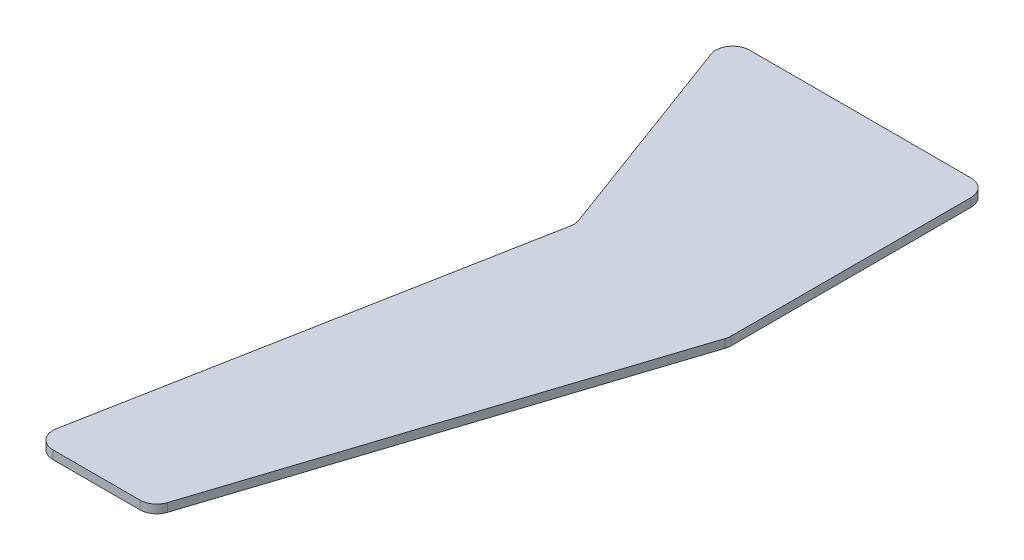
ISO-10303-21;
HEADER;
FILE_DESCRIPTION(('STEP AP214'),'2;1');
FILE_NAME('part.step','',(''),(''),'','','');
FILE_SCHEMA(('AUTOMOTIVE_DESIGN { 1 0 10303 214 1 1 1 1 }'));
ENDSEC;
DATA;
#1=APPLICATION_CONTEXT('core data for automotive mechanical design processes');
#2=APPLICATION_PROTOCOL_DEFINITION('international standard','automotive_design',2000,#1);
#3=PRODUCT_CONTEXT('',#1,'mechanical');
#4=PRODUCT('Part','Part','',(#3));
#5=PRODUCT_RELATED_PRODUCT_CATEGORY('part','',(#4));
#6=PRODUCT_DEFINITION_FORMATION('','',#4);
#7=PRODUCT_DEFINITION_CONTEXT('part definition',#1,'design');
#8=PRODUCT_DEFINITION('design','',#6,#7);
#9=PRODUCT_DEFINITION_SHAPE('','',#8);
#10=(LENGTH_UNIT() NAMED_UNIT(*) SI_UNIT(.MILLI.,.METRE.));
#11=(NAMED_UNIT(*) PLANE_ANGLE_UNIT() SI_UNIT($,.RADIAN.));
#12=(NAMED_UNIT(*) SI_UNIT($,.STERADIAN.) SOLID_ANGLE_UNIT());
#13=UNCERTAINTY_MEASURE_WITH_UNIT(LENGTH_MEASURE(1.E-05),#10,'distance_accuracy_value','');
#14=(GEOMETRIC_REPRESENTATION_CONTEXT(3) GLOBAL_UNCERTAINTY_ASSIGNED_CONTEXT((#13)) GLOBAL_UNIT_ASSIGNED_CONTEXT((#10,
#11,#12)) REPRESENTATION_CONTEXT('',''));
#15=CARTESIAN_POINT('',(0.,0.,0.));
#16=DIRECTION('',(0.,0.,1.));
#17=DIRECTION('',(1.,0.,0.));
#18=AXIS2_PLACEMENT_3D('',#15,#16,#17);
#19=CARTESIAN_POINT('',(-33.7656753020072,2.,112.90623027761));
#20=DIRECTION('',(0.,-1.,0.));
#21=DIRECTION('',(0.,0.,-1.));
#22=AXIS2_PLACEMENT_3D('',#19,#20,#21);
#23=CYLINDRICAL_SURFACE('',#22,4.00000000000002);
#24=CARTESIAN_POINT('',(-33.7656753020072,0.,112.90623027761));
#25=DIRECTION('',(0.,1.,0.));
#26=DIRECTION('',(0.,0.,1.));
#27=AXIS2_PLACEMENT_3D('',#24,#25,#26);
#28=CIRCLE('',#27,4.00000000000002);
#29=CARTESIAN_POINT('',(-37.6966440093124,0.,112.1663079694));
#30=VERTEX_POINT('',#29);
#31=CARTESIAN_POINT('',(-33.7656753020071,0.,116.906230277611));
#32=VERTEX_POINT('',#31);
#33=EDGE_CURVE('E153',#30,#32,#28,.T.);
#34=ORIENTED_EDGE('',*,*,#33,.T.);
#35=DIRECTION('',(0.,-1.,0.));
#36=VECTOR('',#35,1.);
#37=CARTESIAN_POINT('',(-33.7656753020071,2.,116.906230277611));
#38=LINE('',#37,#36);
#39=CARTESIAN_POINT('',(-33.7656753020071,2.,116.906230277611));
#40=VERTEX_POINT('',#39);
#41=EDGE_CURVE('E11',#40,#32,#38,.T.);
#42=ORIENTED_EDGE('',*,*,#41,.F.);
#43=CARTESIAN_POINT('',(-33.7656753020072,2.,112.90623027761));
#44=DIRECTION('',(0.,1.,0.));
#45=DIRECTION('',(0.,0.,1.));
#46=AXIS2_PLACEMENT_3D('',#43,#44,#45);
#47=CIRCLE('',#46,4.00000000000002);
#48=CARTESIAN_POINT('',(-37.6966440093124,2.,112.1663079694));
#49=VERTEX_POINT('',#48);
#50=EDGE_CURVE('E175',#49,#40,#47,.T.);
#51=ORIENTED_EDGE('',*,*,#50,.F.);
#52=DIRECTION('',(0.,-1.,0.));
#53=VECTOR('',#52,1.);
#54=CARTESIAN_POINT('',(-37.6966440093124,2.,112.1663079694));
#55=LINE('',#54,#53);
#56=EDGE_CURVE('E149',#49,#30,#55,.T.);
#57=ORIENTED_EDGE('',*,*,#56,.T.);
#58=EDGE_LOOP('',(#34,#42,#51,#57));
#59=FACE_BOUND('',#58,.T.);
#60=ADVANCED_FACE('F33',(#59),#23,.T.);
#61=CARTESIAN_POINT('',(-13.2776333039589,2.,116.906230277611));
#62=DIRECTION('',(0.,0.,-1.));
#63=DIRECTION('',(-1.,0.,0.));
#64=AXIS2_PLACEMENT_3D('',#61,#62,#63);
#65=PLANE('',#64);
#66=DIRECTION('',(1.,0.,0.));
#67=VECTOR('',#66,1.);
#68=CARTESIAN_POINT('',(-13.2776333039589,0.,116.906230277611));
#69=LINE('',#68,#67);
#70=CARTESIAN_POINT('',(-13.2776333039589,0.,116.906230277611));
#71=VERTEX_POINT('',#70);
#72=EDGE_CURVE('E156',#32,#71,#69,.T.);
#73=ORIENTED_EDGE('',*,*,#72,.T.);
#74=DIRECTION('',(0.,-1.,0.));
#75=VECTOR('',#74,1.);
#76=CARTESIAN_POINT('',(-13.2776333039589,2.,116.906230277611));
#77=LINE('',#76,#75);
#78=CARTESIAN_POINT('',(-13.2776333039589,2.,116.906230277611));
#79=VERTEX_POINT('',#78);
#80=EDGE_CURVE('E41',#79,#71,#77,.T.);
#81=ORIENTED_EDGE('',*,*,#80,.F.);
#82=DIRECTION('',(1.,0.,0.));
#83=VECTOR('',#82,1.);
#84=CARTESIAN_POINT('',(-13.2776333039589,2.,116.906230277611));
#85=LINE('',#84,#83);
#86=EDGE_CURVE('E104',#40,#79,#85,.T.);
#87=ORIENTED_EDGE('',*,*,#86,.F.);
#88=ORIENTED_EDGE('',*,*,#41,.T.);
#89=EDGE_LOOP('',(#73,#81,#87,#88));
#90=FACE_BOUND('',#89,.T.);
#91=ADVANCED_FACE('F253',(#90),#65,.F.);
#92=CARTESIAN_POINT('',(-13.2776333039589,2.,112.906230277611));
#93=DIRECTION('',(0.,-1.,0.));
#94=DIRECTION('',(0.,0.,-1.));
#95=AXIS2_PLACEMENT_3D('',#92,#93,#94);
#96=CYLINDRICAL_SURFACE('',#95,4.);
#97=CARTESIAN_POINT('',(-13.2776333039589,0.,112.906230277611));
#98=DIRECTION('',(0.,1.,0.));
#99=DIRECTION('',(0.,0.,1.));
#100=AXIS2_PLACEMENT_3D('',#97,#98,#99);
#101=CIRCLE('',#100,4.);
#102=CARTESIAN_POINT('',(-9.47340723877824,0.,114.14229825511));
#103=VERTEX_POINT('',#102);
#104=EDGE_CURVE('E158',#71,#103,#101,.T.);
#105=ORIENTED_EDGE('',*,*,#104,.T.);
#106=DIRECTION('',(0.,-1.,0.));
#107=VECTOR('',#106,1.);
#108=CARTESIAN_POINT('',(-9.47340723877824,2.,114.14229825511));
#109=LINE('',#108,#107);
#110=CARTESIAN_POINT('',(-9.47340723877824,2.,114.14229825511));
#111=VERTEX_POINT('',#110);
#112=EDGE_CURVE('E194',#111,#103,#109,.T.);
#113=ORIENTED_EDGE('',*,*,#112,.F.);
#114=CARTESIAN_POINT('',(-13.2776333039589,2.,112.906230277611));
#115=DIRECTION('',(0.,1.,0.));
#116=DIRECTION('',(0.,0.,1.));
#117=AXIS2_PLACEMENT_3D('',#114,#115,#116);
#118=CIRCLE('',#117,4.);
#119=EDGE_CURVE('E202',#79,#111,#118,.T.);
#120=ORIENTED_EDGE('',*,*,#119,.F.);
#121=ORIENTED_EDGE('',*,*,#80,.T.);
#122=EDGE_LOOP('',(#105,#113,#120,#121));
#123=FACE_BOUND('',#122,.T.);
#124=ADVANCED_FACE('F200',(#123),#96,.T.);
#125=CARTESIAN_POINT('',(22.8065982657376,2.,14.7946567339357));
#126=DIRECTION('',(-0.951056516295153,0.,-0.309016994374949));
#127=DIRECTION('',(-0.309016994374949,0.,0.951056516295153));
#128=AXIS2_PLACEMENT_3D('',#125,#126,#127);
#129=PLANE('',#128);
#130=DIRECTION('',(0.309016994374949,0.,-0.951056516295153));
#131=VECTOR('',#130,1.);
#132=CARTESIAN_POINT('',(22.8065982657376,0.,14.7946567339357));
#133=LINE('',#132,#131);
#134=CARTESIAN_POINT('',(22.8065982657376,0.,14.7946567339357));
#135=VERTEX_POINT('',#134);
#136=EDGE_CURVE('E160',#103,#135,#133,.T.);
#137=ORIENTED_EDGE('',*,*,#136,.T.);
#138=DIRECTION('',(0.,-1.,0.));
#139=VECTOR('',#138,1.);
#140=CARTESIAN_POINT('',(22.8065982657376,2.,14.7946567339357));
#141=LINE('',#140,#139);
#142=CARTESIAN_POINT('',(22.8065982657376,2.,14.7946567339357));
#143=VERTEX_POINT('',#142);
#144=EDGE_CURVE('E191',#143,#135,#141,.T.);
#145=ORIENTED_EDGE('',*,*,#144,.F.);
#146=DIRECTION('',(0.309016994374949,0.,-0.951056516295153));
#147=VECTOR('',#146,1.);
#148=CARTESIAN_POINT('',(22.8065982657376,2.,14.7946567339357));
#149=LINE('',#148,#147);
#150=EDGE_CURVE('E220',#111,#143,#149,.T.);
#151=ORIENTED_EDGE('',*,*,#150,.F.);
#152=ORIENTED_EDGE('',*,*,#112,.T.);
#153=EDGE_LOOP('',(#137,#145,#151,#152));
#154=FACE_BOUND('',#153,.T.);
#155=ADVANCED_FACE('F211',(#154),#129,.F.);
#156=CARTESIAN_POINT('',(19.002372200557,2.,13.5585887564359));
#157=DIRECTION('',(0.,-1.,0.));
#158=DIRECTION('',(0.,0.,-1.));
#159=AXIS2_PLACEMENT_3D('',#156,#157,#158);
#160=CYLINDRICAL_SURFACE('',#159,4.);
#161=CARTESIAN_POINT('',(19.002372200557,0.,13.5585887564359));
#162=DIRECTION('',(0.,1.,0.));
#163=DIRECTION('',(0.,0.,1.));
#164=AXIS2_PLACEMENT_3D('',#161,#162,#163);
#165=CIRCLE('',#164,4.);
#166=CARTESIAN_POINT('',(23.002372200557,0.,13.5585887564358));
#167=VERTEX_POINT('',#166);
#168=EDGE_CURVE('E162',#135,#167,#165,.T.);
#169=ORIENTED_EDGE('',*,*,#168,.T.);
#170=DIRECTION('',(0.,-1.,0.));
#171=VECTOR('',#170,1.);
#172=CARTESIAN_POINT('',(23.002372200557,2.,13.5585887564358));
#173=LINE('',#172,#171);
#174=CARTESIAN_POINT('',(23.002372200557,2.,13.5585887564358));
#175=VERTEX_POINT('',#174);
#176=EDGE_CURVE('E188',#175,#167,#173,.T.);
#177=ORIENTED_EDGE('',*,*,#176,.F.);
#178=CARTESIAN_POINT('',(19.002372200557,2.,13.5585887564359));
#179=DIRECTION('',(0.,1.,0.));
#180=DIRECTION('',(0.,0.,1.));
#181=AXIS2_PLACEMENT_3D('',#178,#179,#180);
#182=CIRCLE('',#181,4.);
#183=EDGE_CURVE('E217',#143,#175,#182,.T.);
#184=ORIENTED_EDGE('',*,*,#183,.F.);
#185=ORIENTED_EDGE('',*,*,#144,.T.);
#186=EDGE_LOOP('',(#169,#177,#184,#185));
#187=FACE_BOUND('',#186,.T.);
#188=ADVANCED_FACE('F215',(#187),#160,.T.);
#189=CARTESIAN_POINT('',(23.002372200557,2.,-43.057873482266));
#190=DIRECTION('',(-1.,0.,0.));
#191=DIRECTION('',(0.,0.,1.));
#192=AXIS2_PLACEMENT_3D('',#189,#190,#191);
#193=PLANE('',#192);
#194=DIRECTION('',(0.,0.,-1.));
#195=VECTOR('',#194,1.);
#196=CARTESIAN_POINT('',(23.002372200557,0.,-43.057873482266));
#197=LINE('',#196,#195);
#198=CARTESIAN_POINT('',(23.002372200557,0.,-43.057873482266));
#199=VERTEX_POINT('',#198);
#200=EDGE_CURVE('E164',#167,#199,#197,.T.);
#201=ORIENTED_EDGE('',*,*,#200,.T.);
#202=DIRECTION('',(0.,-1.,0.));
#203=VECTOR('',#202,1.);
#204=CARTESIAN_POINT('',(23.002372200557,2.,-43.057873482266));
#205=LINE('',#204,#203);
#206=CARTESIAN_POINT('',(23.002372200557,2.,-43.057873482266));
#207=VERTEX_POINT('',#206);
#208=EDGE_CURVE('E185',#207,#199,#205,.T.);
#209=ORIENTED_EDGE('',*,*,#208,.F.);
#210=DIRECTION('',(0.,0.,-1.));
#211=VECTOR('',#210,1.);
#212=CARTESIAN_POINT('',(23.002372200557,2.,-43.057873482266));
#213=LINE('',#212,#211);
#214=EDGE_CURVE('E219',#175,#207,#213,.T.);
#215=ORIENTED_EDGE('',*,*,#214,.F.);
#216=ORIENTED_EDGE('',*,*,#176,.T.);
#217=EDGE_LOOP('',(#201,#209,#215,#216));
#218=FACE_BOUND('',#217,.T.);
#219=ADVANCED_FACE('F266',(#218),#193,.F.);
#220=CARTESIAN_POINT('',(19.002372200557,2.,-43.057873482266));
#221=DIRECTION('',(0.,-1.,0.));
#222=DIRECTION('',(0.,0.,-1.));
#223=AXIS2_PLACEMENT_3D('',#220,#221,#222);
#224=CYLINDRICAL_SURFACE('',#223,4.);
#225=CARTESIAN_POINT('',(19.002372200557,0.,-43.057873482266));
#226=DIRECTION('',(0.,1.,0.));
#227=DIRECTION('',(0.,0.,1.));
#228=AXIS2_PLACEMENT_3D('',#225,#226,#227);
#229=CIRCLE('',#228,4.);
#230=CARTESIAN_POINT('',(19.002372200557,0.,-47.057873482266));
#231=VERTEX_POINT('',#230);
#232=EDGE_CURVE('E166',#199,#231,#229,.T.);
#233=ORIENTED_EDGE('',*,*,#232,.T.);
#234=DIRECTION('',(0.,-1.,0.));
#235=VECTOR('',#234,1.);
#236=CARTESIAN_POINT('',(19.002372200557,2.,-47.057873482266));
#237=LINE('',#236,#235);
#238=CARTESIAN_POINT('',(19.002372200557,2.,-47.057873482266));
#239=VERTEX_POINT('',#238);
#240=EDGE_CURVE('E182',#239,#231,#237,.T.);
#241=ORIENTED_EDGE('',*,*,#240,.F.);
#242=CARTESIAN_POINT('',(19.002372200557,2.,-43.057873482266));
#243=DIRECTION('',(0.,1.,0.));
#244=DIRECTION('',(0.,0.,1.));
#245=AXIS2_PLACEMENT_3D('',#242,#243,#244);
#246=CIRCLE('',#245,4.);
#247=EDGE_CURVE('E222',#207,#239,#246,.T.);
#248=ORIENTED_EDGE('',*,*,#247,.F.);
#249=ORIENTED_EDGE('',*,*,#208,.T.);
#250=EDGE_LOOP('',(#233,#241,#248,#249));
#251=FACE_BOUND('',#250,.T.);
#252=ADVANCED_FACE('F269',(#251),#224,.T.);
#253=CARTESIAN_POINT('',(-33.2509469999633,2.,-47.057873482266));
#254=DIRECTION('',(0.,0.,1.));
#255=DIRECTION('',(1.,0.,0.));
#256=AXIS2_PLACEMENT_3D('',#253,#254,#255);
#257=PLANE('',#256);
#258=DIRECTION('',(-1.,0.,0.));
#259=VECTOR('',#258,1.);
#260=CARTESIAN_POINT('',(-33.2509469999633,0.,-47.057873482266));
#261=LINE('',#260,#259);
#262=CARTESIAN_POINT('',(-33.2509469999633,0.,-47.057873482266));
#263=VERTEX_POINT('',#262);
#264=EDGE_CURVE('E168',#231,#263,#261,.T.);
#265=ORIENTED_EDGE('',*,*,#264,.T.);
#266=DIRECTION('',(0.,-1.,0.));
#267=VECTOR('',#266,1.);
#268=CARTESIAN_POINT('',(-33.2509469999633,2.,-47.057873482266));
#269=LINE('',#268,#267);
#270=CARTESIAN_POINT('',(-33.2509469999633,2.,-47.057873482266));
#271=VERTEX_POINT('',#270);
#272=EDGE_CURVE('E179',#271,#263,#269,.T.);
#273=ORIENTED_EDGE('',*,*,#272,.F.);
#274=DIRECTION('',(-1.,0.,0.));
#275=VECTOR('',#274,1.);
#276=CARTESIAN_POINT('',(-33.2509469999633,2.,-47.057873482266));
#277=LINE('',#276,#275);
#278=EDGE_CURVE('E228',#239,#271,#277,.T.);
#279=ORIENTED_EDGE('',*,*,#278,.F.);
#280=ORIENTED_EDGE('',*,*,#240,.T.);
#281=EDGE_LOOP('',(#265,#273,#279,#280));
#282=FACE_BOUND('',#281,.T.);
#283=ADVANCED_FACE('F234',(#282),#257,.F.);
#284=CARTESIAN_POINT('',(-33.2509469999633,2.,-43.057873482266));
#285=DIRECTION('',(0.,-1.,0.));
#286=DIRECTION('',(0.,0.,-1.));
#287=AXIS2_PLACEMENT_3D('',#284,#285,#286);
#288=CYLINDRICAL_SURFACE('',#287,3.99999999999999);
#289=CARTESIAN_POINT('',(-33.2509469999633,0.,-43.057873482266));
#290=DIRECTION('',(0.,1.,0.));
#291=DIRECTION('',(0.,0.,1.));
#292=AXIS2_PLACEMENT_3D('',#289,#290,#291);
#293=CIRCLE('',#292,3.99999999999999);
#294=CARTESIAN_POINT('',(-37.0020180963099,0.,-41.6688214205515));
#295=VERTEX_POINT('',#294);
#296=EDGE_CURVE('E170',#263,#295,#293,.T.);
#297=ORIENTED_EDGE('',*,*,#296,.T.);
#298=DIRECTION('',(0.,-1.,0.));
#299=VECTOR('',#298,1.);
#300=CARTESIAN_POINT('',(-37.0020180963099,2.,-41.6688214205515));
#301=LINE('',#300,#299);
#302=CARTESIAN_POINT('',(-37.0020180963099,2.,-41.6688214205515));
#303=VERTEX_POINT('',#302);
#304=EDGE_CURVE('E144',#303,#295,#301,.T.);
#305=ORIENTED_EDGE('',*,*,#304,.F.);
#306=CARTESIAN_POINT('',(-33.2509469999633,2.,-43.057873482266));
#307=DIRECTION('',(0.,1.,0.));
#308=DIRECTION('',(0.,0.,1.));
#309=AXIS2_PLACEMENT_3D('',#306,#307,#308);
#310=CIRCLE('',#309,3.99999999999999);
#311=EDGE_CURVE('E135',#271,#303,#310,.T.);
#312=ORIENTED_EDGE('',*,*,#311,.F.);
#313=ORIENTED_EDGE('',*,*,#272,.T.);
#314=EDGE_LOOP('',(#297,#305,#312,#313));
#315=FACE_BOUND('',#314,.T.);
#316=ADVANCED_FACE('F238',(#315),#288,.T.);
#317=CARTESIAN_POINT('',(-18.6496308846559,2.,7.89095471456758));
#318=DIRECTION('',(0.937767774086645,0.,-0.347263015428623));
#319=DIRECTION('',(-0.347263015428623,0.,-0.937767774086645));
#320=AXIS2_PLACEMENT_3D('',#317,#318,#319);
#321=PLANE('',#320);
#322=DIRECTION('',(0.347263015428623,0.,0.937767774086645));
#323=VECTOR('',#322,1.);
#324=CARTESIAN_POINT('',(-18.6496308846559,0.,7.89095471456758));
#325=LINE('',#324,#323);
#326=CARTESIAN_POINT('',(-18.6496308846559,0.,7.89095471456758));
#327=VERTEX_POINT('',#326);
#328=EDGE_CURVE('E143',#295,#327,#325,.T.);
#329=ORIENTED_EDGE('',*,*,#328,.T.);
#330=DIRECTION('',(0.,-1.,0.));
#331=VECTOR('',#330,1.);
#332=CARTESIAN_POINT('',(-18.6496308846559,2.,7.89095471456758));
#333=LINE('',#332,#331);
#334=CARTESIAN_POINT('',(-18.6496308846559,2.,7.89095471456758));
#335=VERTEX_POINT('',#334);
#336=EDGE_CURVE('E140',#335,#327,#333,.T.);
#337=ORIENTED_EDGE('',*,*,#336,.F.);
#338=DIRECTION('',(0.347263015428623,0.,0.937767774086645));
#339=VECTOR('',#338,1.);
#340=CARTESIAN_POINT('',(-18.6496308846559,2.,7.89095471456758));
#341=LINE('',#340,#339);
#342=EDGE_CURVE('E129',#303,#335,#341,.T.);
#343=ORIENTED_EDGE('',*,*,#342,.F.);
#344=ORIENTED_EDGE('',*,*,#304,.T.);
#345=EDGE_LOOP('',(#329,#337,#343,#344));
#346=FACE_BOUND('',#345,.T.);
#347=ADVANCED_FACE('F141',(#346),#321,.F.);
#348=CARTESIAN_POINT('',(-22.4007019810025,2.,9.28000677628208));
#349=DIRECTION('',(0.,-1.,0.));
#350=DIRECTION('',(0.,0.,-1.));
#351=AXIS2_PLACEMENT_3D('',#348,#349,#350);
#352=CYLINDRICAL_SURFACE('',#351,4.);
#353=CARTESIAN_POINT('',(-22.4007019810025,0.,9.28000677628208));
#354=DIRECTION('',(0.,-1.,0.));
#355=DIRECTION('',(0.,0.,1.));
#356=AXIS2_PLACEMENT_3D('',#353,#354,#355);
#357=CIRCLE('',#356,4.);
#358=CARTESIAN_POINT('',(-18.4697332736973,0.,10.0199290844925));
#359=VERTEX_POINT('',#358);
#360=EDGE_CURVE('E90',#327,#359,#357,.T.);
#361=ORIENTED_EDGE('',*,*,#360,.T.);
#362=DIRECTION('',(0.,-1.,0.));
#363=VECTOR('',#362,1.);
#364=CARTESIAN_POINT('',(-18.4697332736973,2.,10.0199290844925));
#365=LINE('',#364,#363);
#366=CARTESIAN_POINT('',(-18.4697332736973,2.,10.0199290844925));
#367=VERTEX_POINT('',#366);
#368=EDGE_CURVE('E145',#367,#359,#365,.T.);
#369=ORIENTED_EDGE('',*,*,#368,.F.);
#370=CARTESIAN_POINT('',(-22.4007019810025,2.,9.28000677628208));
#371=DIRECTION('',(0.,-1.,0.));
#372=DIRECTION('',(0.,0.,1.));
#373=AXIS2_PLACEMENT_3D('',#370,#371,#372);
#374=CIRCLE('',#373,4.);
#375=EDGE_CURVE('E133',#335,#367,#374,.T.);
#376=ORIENTED_EDGE('',*,*,#375,.F.);
#377=ORIENTED_EDGE('',*,*,#336,.T.);
#378=EDGE_LOOP('',(#361,#369,#376,#377));
#379=FACE_BOUND('',#378,.T.);
#380=ADVANCED_FACE('F147',(#379),#352,.F.);
#381=CARTESIAN_POINT('',(-37.6966440093124,2.,112.1663079694));
#382=DIRECTION('',(0.982742176826297,0.,0.184980577052595));
#383=DIRECTION('',(0.184980577052595,0.,-0.982742176826297));
#384=AXIS2_PLACEMENT_3D('',#381,#382,#383);
#385=PLANE('',#384);
#386=DIRECTION('',(-0.184980577052595,0.,0.982742176826297));
#387=VECTOR('',#386,1.);
#388=CARTESIAN_POINT('',(-37.6966440093124,0.,112.1663079694));
#389=LINE('',#388,#387);
#390=EDGE_CURVE('E96',#359,#30,#389,.T.);
#391=ORIENTED_EDGE('',*,*,#390,.T.);
#392=ORIENTED_EDGE('',*,*,#56,.F.);
#393=DIRECTION('',(-0.184980577052595,0.,0.982742176826297));
#394=VECTOR('',#393,1.);
#395=CARTESIAN_POINT('',(-37.6966440093124,2.,112.1663079694));
#396=LINE('',#395,#394);
#397=EDGE_CURVE('E49',#367,#49,#396,.T.);
#398=ORIENTED_EDGE('',*,*,#397,.F.);
#399=ORIENTED_EDGE('',*,*,#368,.T.);
#400=EDGE_LOOP('',(#391,#392,#398,#399));
#401=FACE_BOUND('',#400,.T.);
#402=ADVANCED_FACE('F242',(#401),#385,.F.);
#403=CARTESIAN_POINT('',(-33.7656753020072,2.,112.90623027761));
#404=DIRECTION('',(0.,1.,0.));
#405=DIRECTION('',(0.,0.,1.));
#406=AXIS2_PLACEMENT_3D('',#403,#404,#405);
#407=PLANE('',#406);
#408=ORIENTED_EDGE('',*,*,#50,.T.);
#409=ORIENTED_EDGE('',*,*,#86,.T.);
#410=ORIENTED_EDGE('',*,*,#119,.T.);
#411=ORIENTED_EDGE('',*,*,#150,.T.);
#412=ORIENTED_EDGE('',*,*,#183,.T.);
#413=ORIENTED_EDGE('',*,*,#214,.T.);
#414=ORIENTED_EDGE('',*,*,#247,.T.);
#415=ORIENTED_EDGE('',*,*,#278,.T.);
#416=ORIENTED_EDGE('',*,*,#311,.T.);
#417=ORIENTED_EDGE('',*,*,#342,.T.);
#418=ORIENTED_EDGE('',*,*,#375,.T.);
#419=ORIENTED_EDGE('',*,*,#397,.T.);
#420=EDGE_LOOP('',(#408,#409,#410,#411,#412,#413,#414,#415,#416,#417,#418,#419));
#421=FACE_BOUND('',#420,.T.);
#422=ADVANCED_FACE('F131',(#421),#407,.T.);
#423=CARTESIAN_POINT('',(-33.7656753020072,0.,112.90623027761));
#424=DIRECTION('',(0.,1.,0.));
#425=DIRECTION('',(0.,0.,1.));
#426=AXIS2_PLACEMENT_3D('',#423,#424,#425);
#427=PLANE('',#426);
#428=ORIENTED_EDGE('',*,*,#33,.F.);
#429=ORIENTED_EDGE('',*,*,#390,.F.);
#430=ORIENTED_EDGE('',*,*,#360,.F.);
#431=ORIENTED_EDGE('',*,*,#328,.F.);
#432=ORIENTED_EDGE('',*,*,#296,.F.);
#433=ORIENTED_EDGE('',*,*,#264,.F.);
#434=ORIENTED_EDGE('',*,*,#232,.F.);
#435=ORIENTED_EDGE('',*,*,#200,.F.);
#436=ORIENTED_EDGE('',*,*,#168,.F.);
#437=ORIENTED_EDGE('',*,*,#136,.F.);
#438=ORIENTED_EDGE('',*,*,#104,.F.);
#439=ORIENTED_EDGE('',*,*,#72,.F.);
#440=EDGE_LOOP('',(#428,#429,#430,#431,#432,#433,#434,#435,#436,#437,#438,#439));
#441=FACE_BOUND('',#440,.T.);
#442=ADVANCED_FACE('F206',(#441),#427,.F.);
#443=CLOSED_SHELL('',(#60,#91,#124,#155,#188,#219,#252,#283,#316,#347,#380,#402,#422,#442));
#444=MANIFOLD_SOLID_BREP('B2',#443);
#445=ADVANCED_BREP_SHAPE_REPRESENTATION('',(#18,#444),#14);
#446=SHAPE_DEFINITION_REPRESENTATION(#9,#445);
ENDSEC;
END-ISO-10303-21;
